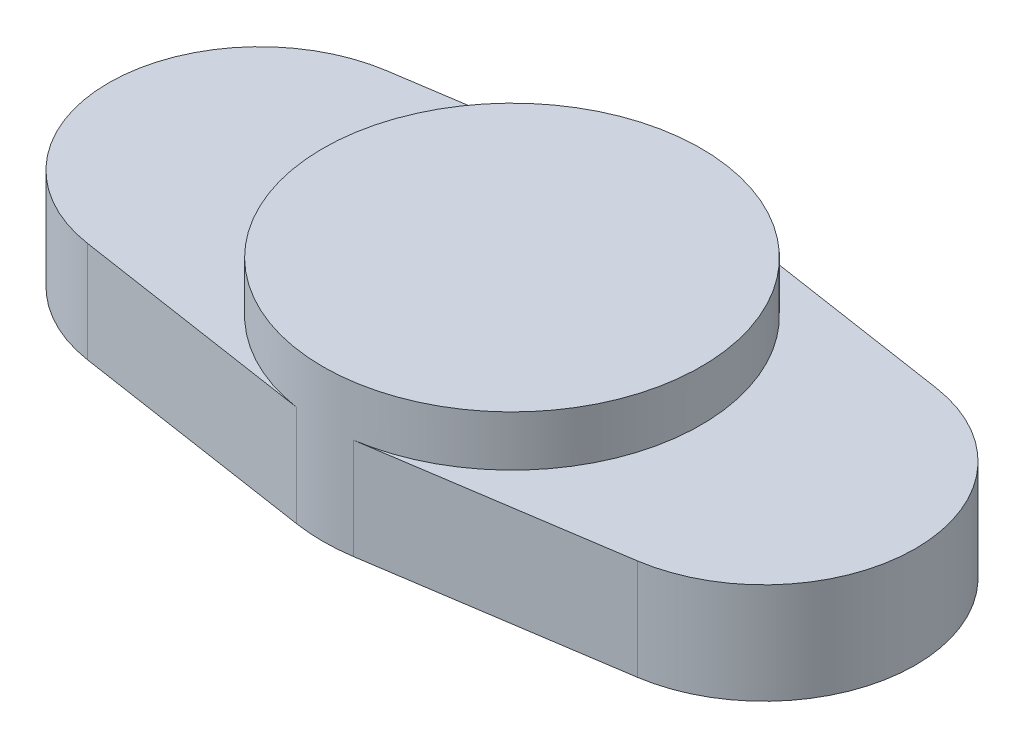
ISO-10303-21;
HEADER;
FILE_DESCRIPTION(('STEP AP214'),'2;1');
FILE_NAME('part.step','',(''),(''),'','','');
FILE_SCHEMA(('AUTOMOTIVE_DESIGN { 1 0 10303 214 1 1 1 1 }'));
ENDSEC;
DATA;
#1=APPLICATION_CONTEXT('core data for automotive mechanical design processes');
#2=APPLICATION_PROTOCOL_DEFINITION('international standard','automotive_design',2000,#1);
#3=PRODUCT_CONTEXT('',#1,'mechanical');
#4=PRODUCT('Part','Part','',(#3));
#5=PRODUCT_RELATED_PRODUCT_CATEGORY('part','',(#4));
#6=PRODUCT_DEFINITION_FORMATION('','',#4);
#7=PRODUCT_DEFINITION_CONTEXT('part definition',#1,'design');
#8=PRODUCT_DEFINITION('design','',#6,#7);
#9=PRODUCT_DEFINITION_SHAPE('','',#8);
#10=(LENGTH_UNIT() NAMED_UNIT(*) SI_UNIT(.MILLI.,.METRE.));
#11=(NAMED_UNIT(*) PLANE_ANGLE_UNIT() SI_UNIT($,.RADIAN.));
#12=(NAMED_UNIT(*) SI_UNIT($,.STERADIAN.) SOLID_ANGLE_UNIT());
#13=UNCERTAINTY_MEASURE_WITH_UNIT(LENGTH_MEASURE(1.E-05),#10,'distance_accuracy_value','');
#14=(GEOMETRIC_REPRESENTATION_CONTEXT(3) GLOBAL_UNCERTAINTY_ASSIGNED_CONTEXT((#13)) GLOBAL_UNIT_ASSIGNED_CONTEXT((#10,
#11,#12)) REPRESENTATION_CONTEXT('',''));
#15=CARTESIAN_POINT('',(0.,0.,0.));
#16=DIRECTION('',(0.,0.,1.));
#17=DIRECTION('',(1.,0.,0.));
#18=AXIS2_PLACEMENT_3D('',#15,#16,#17);
#19=CARTESIAN_POINT('',(0.,2.,0.));
#20=DIRECTION('',(0.,1.,0.));
#21=DIRECTION('',(0.,0.,1.));
#22=AXIS2_PLACEMENT_3D('',#19,#20,#21);
#23=PLANE('',#22);
#24=CARTESIAN_POINT('',(0.,2.,0.));
#25=DIRECTION('',(0.,1.,0.));
#26=DIRECTION('',(0.,0.,1.));
#27=AXIS2_PLACEMENT_3D('',#24,#25,#26);
#28=CIRCLE('',#27,3.75);
#29=CARTESIAN_POINT('',(0.5625,2.,3.70757248749097));
#30=VERTEX_POINT('',#29);
#31=CARTESIAN_POINT('',(0.5625,2.,-3.70757248749097));
#32=VERTEX_POINT('',#31);
#33=EDGE_CURVE('E48',#30,#32,#28,.T.);
#34=ORIENTED_EDGE('',*,*,#33,.F.);
#35=DIRECTION('',(0.988685996664259,0.,-0.15));
#36=VECTOR('',#35,1.);
#37=CARTESIAN_POINT('',(0.5625,2.,3.70757248749097));
#38=LINE('',#37,#36);
#39=CARTESIAN_POINT('',(5.45,2.,2.96605798999278));
#40=VERTEX_POINT('',#39);
#41=EDGE_CURVE('E110',#30,#40,#38,.T.);
#42=ORIENTED_EDGE('',*,*,#41,.T.);
#43=CARTESIAN_POINT('',(5.,2.,0.));
#44=DIRECTION('',(0.,1.,0.));
#45=DIRECTION('',(0.,0.,1.));
#46=AXIS2_PLACEMENT_3D('',#43,#44,#45);
#47=CIRCLE('',#46,3.);
#48=CARTESIAN_POINT('',(5.45,2.,-2.96605798999278));
#49=VERTEX_POINT('',#48);
#50=EDGE_CURVE('E113',#40,#49,#47,.T.);
#51=ORIENTED_EDGE('',*,*,#50,.T.);
#52=DIRECTION('',(-0.988685996664259,0.,-0.15));
#53=VECTOR('',#52,1.);
#54=CARTESIAN_POINT('',(0.5625,2.,-3.70757248749097));
#55=LINE('',#54,#53);
#56=EDGE_CURVE('E56',#49,#32,#55,.T.);
#57=ORIENTED_EDGE('',*,*,#56,.T.);
#58=EDGE_LOOP('',(#34,#42,#51,#57));
#59=FACE_BOUND('',#58,.T.);
#60=ADVANCED_FACE('F37',(#59),#23,.T.);
#61=CARTESIAN_POINT('',(-5.45,2.,-2.96605798999278));
#62=DIRECTION('',(0.15,0.,0.988685996664259));
#63=DIRECTION('',(0.98868599666426,0.,-0.15));
#64=AXIS2_PLACEMENT_3D('',#61,#62,#63);
#65=PLANE('',#64);
#66=DIRECTION('',(-0.988685996664259,0.,0.15));
#67=VECTOR('',#66,1.);
#68=CARTESIAN_POINT('',(-5.45,0.,-2.96605798999278));
#69=LINE('',#68,#67);
#70=CARTESIAN_POINT('',(-0.5625,0.,-3.70757248749097));
#71=VERTEX_POINT('',#70);
#72=CARTESIAN_POINT('',(-5.45,0.,-2.96605798999278));
#73=VERTEX_POINT('',#72);
#74=EDGE_CURVE('E136',#71,#73,#69,.T.);
#75=ORIENTED_EDGE('',*,*,#74,.T.);
#76=DIRECTION('',(0.,-1.,0.));
#77=VECTOR('',#76,1.);
#78=CARTESIAN_POINT('',(-5.45,2.,-2.96605798999278));
#79=LINE('',#78,#77);
#80=CARTESIAN_POINT('',(-5.45,2.,-2.96605798999278));
#81=VERTEX_POINT('',#80);
#82=EDGE_CURVE('E157',#81,#73,#79,.T.);
#83=ORIENTED_EDGE('',*,*,#82,.F.);
#84=DIRECTION('',(-0.988685996664259,0.,0.15));
#85=VECTOR('',#84,1.);
#86=CARTESIAN_POINT('',(-5.45,2.,-2.96605798999278));
#87=LINE('',#86,#85);
#88=CARTESIAN_POINT('',(-0.5625,2.,-3.70757248749097));
#89=VERTEX_POINT('',#88);
#90=EDGE_CURVE('E148',#89,#81,#87,.T.);
#91=ORIENTED_EDGE('',*,*,#90,.F.);
#92=DIRECTION('',(0.,-1.,0.));
#93=VECTOR('',#92,1.);
#94=CARTESIAN_POINT('',(-0.5625,2.,-3.70757248749097));
#95=LINE('',#94,#93);
#96=EDGE_CURVE('E41',#89,#71,#95,.T.);
#97=ORIENTED_EDGE('',*,*,#96,.T.);
#98=EDGE_LOOP('',(#75,#83,#91,#97));
#99=FACE_BOUND('',#98,.T.);
#100=ADVANCED_FACE('F39',(#99),#65,.F.);
#101=CARTESIAN_POINT('',(-5.,2.,0.));
#102=DIRECTION('',(0.,-1.,0.));
#103=DIRECTION('',(0.,0.,-1.));
#104=AXIS2_PLACEMENT_3D('',#101,#102,#103);
#105=CYLINDRICAL_SURFACE('',#104,3.);
#106=CARTESIAN_POINT('',(-5.,0.,0.));
#107=DIRECTION('',(0.,1.,0.));
#108=DIRECTION('',(0.,0.,1.));
#109=AXIS2_PLACEMENT_3D('',#106,#107,#108);
#110=CIRCLE('',#109,3.);
#111=CARTESIAN_POINT('',(-5.45,0.,2.96605798999278));
#112=VERTEX_POINT('',#111);
#113=EDGE_CURVE('E139',#73,#112,#110,.T.);
#114=ORIENTED_EDGE('',*,*,#113,.T.);
#115=DIRECTION('',(0.,-1.,0.));
#116=VECTOR('',#115,1.);
#117=CARTESIAN_POINT('',(-5.45,2.,2.96605798999278));
#118=LINE('',#117,#116);
#119=CARTESIAN_POINT('',(-5.45,2.,2.96605798999278));
#120=VERTEX_POINT('',#119);
#121=EDGE_CURVE('E155',#120,#112,#118,.T.);
#122=ORIENTED_EDGE('',*,*,#121,.F.);
#123=CARTESIAN_POINT('',(-5.,2.,0.));
#124=DIRECTION('',(0.,1.,0.));
#125=DIRECTION('',(0.,0.,1.));
#126=AXIS2_PLACEMENT_3D('',#123,#124,#125);
#127=CIRCLE('',#126,3.);
#128=EDGE_CURVE('E180',#81,#120,#127,.T.);
#129=ORIENTED_EDGE('',*,*,#128,.F.);
#130=ORIENTED_EDGE('',*,*,#82,.T.);
#131=EDGE_LOOP('',(#114,#122,#129,#130));
#132=FACE_BOUND('',#131,.T.);
#133=ADVANCED_FACE('F175',(#132),#105,.T.);
#134=CARTESIAN_POINT('',(-5.45,2.,2.96605798999278));
#135=DIRECTION('',(0.15,0.,-0.988685996664259));
#136=DIRECTION('',(-0.98868599666426,0.,-0.15));
#137=AXIS2_PLACEMENT_3D('',#134,#135,#136);
#138=PLANE('',#137);
#139=DIRECTION('',(0.988685996664259,0.,0.15));
#140=VECTOR('',#139,1.);
#141=CARTESIAN_POINT('',(-5.45,0.,2.96605798999278));
#142=LINE('',#141,#140);
#143=CARTESIAN_POINT('',(-0.562499999999999,0.,3.70757248749097));
#144=VERTEX_POINT('',#143);
#145=EDGE_CURVE('E141',#112,#144,#142,.T.);
#146=ORIENTED_EDGE('',*,*,#145,.T.);
#147=DIRECTION('',(0.,-1.,0.));
#148=VECTOR('',#147,1.);
#149=CARTESIAN_POINT('',(-0.562499999999999,2.,3.70757248749097));
#150=LINE('',#149,#148);
#151=CARTESIAN_POINT('',(-0.562499999999999,2.,3.70757248749097));
#152=VERTEX_POINT('',#151);
#153=EDGE_CURVE('E152',#152,#144,#150,.T.);
#154=ORIENTED_EDGE('',*,*,#153,.F.);
#155=DIRECTION('',(0.988685996664259,0.,0.15));
#156=VECTOR('',#155,1.);
#157=CARTESIAN_POINT('',(-5.45,2.,2.96605798999278));
#158=LINE('',#157,#156);
#159=EDGE_CURVE('E118',#120,#152,#158,.T.);
#160=ORIENTED_EDGE('',*,*,#159,.F.);
#161=ORIENTED_EDGE('',*,*,#121,.T.);
#162=EDGE_LOOP('',(#146,#154,#160,#161));
#163=FACE_BOUND('',#162,.T.);
#164=ADVANCED_FACE('F178',(#163),#138,.F.);
#165=CARTESIAN_POINT('',(0.,2.,0.));
#166=DIRECTION('',(0.,-1.,0.));
#167=DIRECTION('',(0.,0.,-1.));
#168=AXIS2_PLACEMENT_3D('',#165,#166,#167);
#169=CYLINDRICAL_SURFACE('',#168,3.75);
#170=CARTESIAN_POINT('',(0.,0.,0.));
#171=DIRECTION('',(0.,1.,0.));
#172=DIRECTION('',(0.,0.,1.));
#173=AXIS2_PLACEMENT_3D('',#170,#171,#172);
#174=CIRCLE('',#173,3.75);
#175=CARTESIAN_POINT('',(0.5625,0.,3.70757248749097));
#176=VERTEX_POINT('',#175);
#177=EDGE_CURVE('E143',#144,#176,#174,.T.);
#178=ORIENTED_EDGE('',*,*,#177,.T.);
#179=DIRECTION('',(0.,-1.,0.));
#180=VECTOR('',#179,1.);
#181=CARTESIAN_POINT('',(0.5625,2.,3.70757248749097));
#182=LINE('',#181,#180);
#183=EDGE_CURVE('E124',#30,#176,#182,.T.);
#184=ORIENTED_EDGE('',*,*,#183,.F.);
#185=ORIENTED_EDGE('',*,*,#33,.T.);
#186=DIRECTION('',(0.,-1.,0.));
#187=VECTOR('',#186,1.);
#188=CARTESIAN_POINT('',(0.5625,2.,-3.70757248749097));
#189=LINE('',#188,#187);
#190=CARTESIAN_POINT('',(0.5625,0.,-3.70757248749097));
#191=VERTEX_POINT('',#190);
#192=EDGE_CURVE('E129',#32,#191,#189,.T.);
#193=ORIENTED_EDGE('',*,*,#192,.T.);
#194=CARTESIAN_POINT('',(0.,0.,0.));
#195=DIRECTION('',(0.,1.,0.));
#196=DIRECTION('',(0.,0.,1.));
#197=AXIS2_PLACEMENT_3D('',#194,#195,#196);
#198=CIRCLE('',#197,3.75);
#199=EDGE_CURVE('E133',#191,#71,#198,.T.);
#200=ORIENTED_EDGE('',*,*,#199,.T.);
#201=ORIENTED_EDGE('',*,*,#96,.F.);
#202=EDGE_CURVE('E11',#89,#152,#28,.T.);
#203=ORIENTED_EDGE('',*,*,#202,.T.);
#204=ORIENTED_EDGE('',*,*,#153,.T.);
#205=EDGE_LOOP('',(#178,#184,#185,#193,#200,#201,#203,#204));
#206=FACE_BOUND('',#205,.T.);
#207=CARTESIAN_POINT('',(0.,3.,0.));
#208=DIRECTION('',(0.,1.,0.));
#209=DIRECTION('',(0.,0.,1.));
#210=AXIS2_PLACEMENT_3D('',#207,#208,#209);
#211=CIRCLE('',#210,3.75);
#212=CARTESIAN_POINT('',(0.,3.,3.75));
#213=VERTEX_POINT('',#212);
#214=EDGE_CURVE('E137',#213,#213,#211,.T.);
#215=ORIENTED_EDGE('',*,*,#214,.F.);
#216=EDGE_LOOP('',(#215));
#217=FACE_BOUND('',#216,.T.);
#218=ADVANCED_FACE('F168',(#206,#217),#169,.T.);
#219=CARTESIAN_POINT('',(0.5625,2.,3.70757248749097));
#220=DIRECTION('',(-0.15,0.,-0.988685996664259));
#221=DIRECTION('',(-0.98868599666426,0.,0.15));
#222=AXIS2_PLACEMENT_3D('',#219,#220,#221);
#223=PLANE('',#222);
#224=DIRECTION('',(0.988685996664259,0.,-0.15));
#225=VECTOR('',#224,1.);
#226=CARTESIAN_POINT('',(0.5625,0.,3.70757248749097));
#227=LINE('',#226,#225);
#228=CARTESIAN_POINT('',(5.45,0.,2.96605798999278));
#229=VERTEX_POINT('',#228);
#230=EDGE_CURVE('E123',#176,#229,#227,.T.);
#231=ORIENTED_EDGE('',*,*,#230,.T.);
#232=DIRECTION('',(0.,-1.,0.));
#233=VECTOR('',#232,1.);
#234=CARTESIAN_POINT('',(5.45,2.,2.96605798999278));
#235=LINE('',#234,#233);
#236=EDGE_CURVE('E120',#40,#229,#235,.T.);
#237=ORIENTED_EDGE('',*,*,#236,.F.);
#238=ORIENTED_EDGE('',*,*,#41,.F.);
#239=ORIENTED_EDGE('',*,*,#183,.T.);
#240=EDGE_LOOP('',(#231,#237,#238,#239));
#241=FACE_BOUND('',#240,.T.);
#242=ADVANCED_FACE('F121',(#241),#223,.F.);
#243=CARTESIAN_POINT('',(5.,2.,0.));
#244=DIRECTION('',(0.,-1.,0.));
#245=DIRECTION('',(0.,0.,-1.));
#246=AXIS2_PLACEMENT_3D('',#243,#244,#245);
#247=CYLINDRICAL_SURFACE('',#246,3.);
#248=CARTESIAN_POINT('',(5.,0.,0.));
#249=DIRECTION('',(0.,1.,0.));
#250=DIRECTION('',(0.,0.,1.));
#251=AXIS2_PLACEMENT_3D('',#248,#249,#250);
#252=CIRCLE('',#251,3.);
#253=CARTESIAN_POINT('',(5.45,0.,-2.96605798999278));
#254=VERTEX_POINT('',#253);
#255=EDGE_CURVE('E86',#229,#254,#252,.T.);
#256=ORIENTED_EDGE('',*,*,#255,.T.);
#257=DIRECTION('',(0.,-1.,0.));
#258=VECTOR('',#257,1.);
#259=CARTESIAN_POINT('',(5.45,2.,-2.96605798999278));
#260=LINE('',#259,#258);
#261=EDGE_CURVE('E125',#49,#254,#260,.T.);
#262=ORIENTED_EDGE('',*,*,#261,.F.);
#263=ORIENTED_EDGE('',*,*,#50,.F.);
#264=ORIENTED_EDGE('',*,*,#236,.T.);
#265=EDGE_LOOP('',(#256,#262,#263,#264));
#266=FACE_BOUND('',#265,.T.);
#267=ADVANCED_FACE('F127',(#266),#247,.T.);
#268=CARTESIAN_POINT('',(0.5625,2.,-3.70757248749097));
#269=DIRECTION('',(-0.15,0.,0.988685996664259));
#270=DIRECTION('',(0.98868599666426,0.,0.15));
#271=AXIS2_PLACEMENT_3D('',#268,#269,#270);
#272=PLANE('',#271);
#273=DIRECTION('',(-0.988685996664259,0.,-0.15));
#274=VECTOR('',#273,1.);
#275=CARTESIAN_POINT('',(0.5625,0.,-3.70757248749097));
#276=LINE('',#275,#274);
#277=EDGE_CURVE('E92',#254,#191,#276,.T.);
#278=ORIENTED_EDGE('',*,*,#277,.T.);
#279=ORIENTED_EDGE('',*,*,#192,.F.);
#280=ORIENTED_EDGE('',*,*,#56,.F.);
#281=ORIENTED_EDGE('',*,*,#261,.T.);
#282=EDGE_LOOP('',(#278,#279,#280,#281));
#283=FACE_BOUND('',#282,.T.);
#284=ADVANCED_FACE('F211',(#283),#272,.F.);
#285=ORIENTED_EDGE('',*,*,#202,.F.);
#286=ORIENTED_EDGE('',*,*,#90,.T.);
#287=ORIENTED_EDGE('',*,*,#128,.T.);
#288=ORIENTED_EDGE('',*,*,#159,.T.);
#289=EDGE_LOOP('',(#285,#286,#287,#288));
#290=FACE_BOUND('',#289,.T.);
#291=ADVANCED_FACE('F203',(#290),#23,.T.);
#292=CARTESIAN_POINT('',(0.,0.,0.));
#293=DIRECTION('',(0.,1.,0.));
#294=DIRECTION('',(0.,0.,1.));
#295=AXIS2_PLACEMENT_3D('',#292,#293,#294);
#296=PLANE('',#295);
#297=CARTESIAN_POINT('',(0.,0.,0.));
#298=DIRECTION('',(0.,-1.,0.));
#299=DIRECTION('',(0.,0.,-1.));
#300=AXIS2_PLACEMENT_3D('',#297,#298,#299);
#301=CIRCLE('',#300,2.75);
#302=CARTESIAN_POINT('',(0.,0.,-2.75));
#303=VERTEX_POINT('',#302);
#304=EDGE_CURVE('E187',#303,#303,#301,.T.);
#305=ORIENTED_EDGE('',*,*,#304,.F.);
#306=EDGE_LOOP('',(#305));
#307=FACE_BOUND('',#306,.T.);
#308=ORIENTED_EDGE('',*,*,#199,.F.);
#309=ORIENTED_EDGE('',*,*,#277,.F.);
#310=ORIENTED_EDGE('',*,*,#255,.F.);
#311=ORIENTED_EDGE('',*,*,#230,.F.);
#312=ORIENTED_EDGE('',*,*,#177,.F.);
#313=ORIENTED_EDGE('',*,*,#145,.F.);
#314=ORIENTED_EDGE('',*,*,#113,.F.);
#315=ORIENTED_EDGE('',*,*,#74,.F.);
#316=EDGE_LOOP('',(#308,#309,#310,#311,#312,#313,#314,#315));
#317=FACE_BOUND('',#316,.T.);
#318=ADVANCED_FACE('F171',(#307,#317),#296,.F.);
#319=CARTESIAN_POINT('',(0.,3.,0.));
#320=DIRECTION('',(0.,1.,0.));
#321=DIRECTION('',(0.,0.,1.));
#322=AXIS2_PLACEMENT_3D('',#319,#320,#321);
#323=PLANE('',#322);
#324=ORIENTED_EDGE('',*,*,#214,.T.);
#325=EDGE_LOOP('',(#324));
#326=FACE_BOUND('',#325,.T.);
#327=ADVANCED_FACE('F198',(#326),#323,.T.);
#328=CARTESIAN_POINT('',(0.,1.,0.));
#329=DIRECTION('',(0.,-1.,0.));
#330=DIRECTION('',(0.,0.,-1.));
#331=AXIS2_PLACEMENT_3D('',#328,#329,#330);
#332=CYLINDRICAL_SURFACE('',#331,2.75);
#333=CARTESIAN_POINT('',(0.,1.,0.));
#334=DIRECTION('',(0.,-1.,0.));
#335=DIRECTION('',(0.,0.,-1.));
#336=AXIS2_PLACEMENT_3D('',#333,#334,#335);
#337=CIRCLE('',#336,2.75);
#338=CARTESIAN_POINT('',(0.,1.,-2.75));
#339=VERTEX_POINT('',#338);
#340=EDGE_CURVE('E184',#339,#339,#337,.T.);
#341=ORIENTED_EDGE('',*,*,#340,.F.);
#342=EDGE_LOOP('',(#341));
#343=FACE_BOUND('',#342,.T.);
#344=ORIENTED_EDGE('',*,*,#304,.T.);
#345=EDGE_LOOP('',(#344));
#346=FACE_BOUND('',#345,.T.);
#347=ADVANCED_FACE('F195',(#343,#346),#332,.F.);
#348=CARTESIAN_POINT('',(0.,1.,0.));
#349=DIRECTION('',(0.,-1.,0.));
#350=DIRECTION('',(0.,0.,-1.));
#351=AXIS2_PLACEMENT_3D('',#348,#349,#350);
#352=PLANE('',#351);
#353=ORIENTED_EDGE('',*,*,#340,.T.);
#354=EDGE_LOOP('',(#353));
#355=FACE_BOUND('',#354,.T.);
#356=ADVANCED_FACE('F193',(#355),#352,.T.);
#357=CLOSED_SHELL('',(#60,#100,#133,#164,#218,#242,#267,#284,#291,#318,#327,#347,#356));
#358=MANIFOLD_SOLID_BREP('B2',#357);
#359=ADVANCED_BREP_SHAPE_REPRESENTATION('',(#18,#358),#14);
#360=SHAPE_DEFINITION_REPRESENTATION(#9,#359);
ENDSEC;
END-ISO-10303-21;
